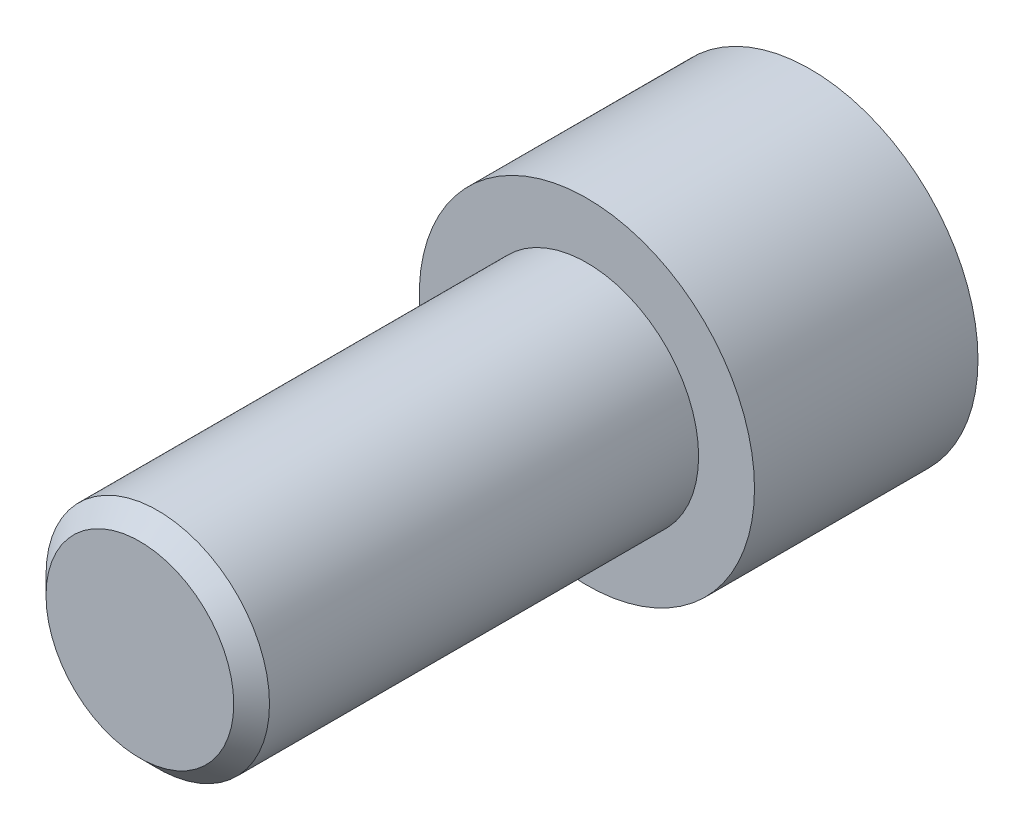
ISO-10303-21;
HEADER;
FILE_DESCRIPTION(('STEP AP214'),'2;1');
FILE_NAME('part.step','',(''),(''),'','','');
FILE_SCHEMA(('AUTOMOTIVE_DESIGN { 1 0 10303 214 1 1 1 1 }'));
ENDSEC;
DATA;
#1=APPLICATION_CONTEXT('core data for automotive mechanical design processes');
#2=APPLICATION_PROTOCOL_DEFINITION('international standard','automotive_design',2000,#1);
#3=PRODUCT_CONTEXT('',#1,'mechanical');
#4=PRODUCT('Part','Part','',(#3));
#5=PRODUCT_RELATED_PRODUCT_CATEGORY('part','',(#4));
#6=PRODUCT_DEFINITION_FORMATION('','',#4);
#7=PRODUCT_DEFINITION_CONTEXT('part definition',#1,'design');
#8=PRODUCT_DEFINITION('design','',#6,#7);
#9=PRODUCT_DEFINITION_SHAPE('','',#8);
#10=(LENGTH_UNIT() NAMED_UNIT(*) SI_UNIT(.MILLI.,.METRE.));
#11=(NAMED_UNIT(*) PLANE_ANGLE_UNIT() SI_UNIT($,.RADIAN.));
#12=(NAMED_UNIT(*) SI_UNIT($,.STERADIAN.) SOLID_ANGLE_UNIT());
#13=UNCERTAINTY_MEASURE_WITH_UNIT(LENGTH_MEASURE(1.E-05),#10,'distance_accuracy_value','');
#14=(GEOMETRIC_REPRESENTATION_CONTEXT(3) GLOBAL_UNCERTAINTY_ASSIGNED_CONTEXT((#13)) GLOBAL_UNIT_ASSIGNED_CONTEXT((#10,
#11,#12)) REPRESENTATION_CONTEXT('',''));
#15=CARTESIAN_POINT('',(0.,0.,0.));
#16=DIRECTION('',(0.,0.,1.));
#17=DIRECTION('',(1.,0.,0.));
#18=AXIS2_PLACEMENT_3D('',#15,#16,#17);
#19=CARTESIAN_POINT('',(0.,0.,-6.35));
#20=DIRECTION('',(0.,0.,1.));
#21=DIRECTION('',(1.,0.,0.));
#22=AXIS2_PLACEMENT_3D('',#19,#20,#21);
#23=CYLINDRICAL_SURFACE('',#22,4.7625);
#24=CARTESIAN_POINT('',(0.,0.,-6.35));
#25=DIRECTION('',(0.,0.,1.));
#26=DIRECTION('',(1.,0.,0.));
#27=AXIS2_PLACEMENT_3D('',#24,#25,#26);
#28=CIRCLE('',#27,4.7625);
#29=CARTESIAN_POINT('',(4.7625,0.,-6.35));
#30=VERTEX_POINT('',#29);
#31=EDGE_CURVE('E175',#30,#30,#28,.T.);
#32=ORIENTED_EDGE('',*,*,#31,.T.);
#33=EDGE_LOOP('',(#32));
#34=FACE_BOUND('',#33,.T.);
#35=CARTESIAN_POINT('',(0.,0.,0.));
#36=DIRECTION('',(0.,0.,1.));
#37=DIRECTION('',(1.,0.,0.));
#38=AXIS2_PLACEMENT_3D('',#35,#36,#37);
#39=CIRCLE('',#38,4.7625);
#40=CARTESIAN_POINT('',(4.7625,0.,0.));
#41=VERTEX_POINT('',#40);
#42=EDGE_CURVE('E161',#41,#41,#39,.T.);
#43=ORIENTED_EDGE('',*,*,#42,.F.);
#44=EDGE_LOOP('',(#43));
#45=FACE_BOUND('',#44,.T.);
#46=ADVANCED_FACE('F45',(#34,#45),#23,.T.);
#47=CARTESIAN_POINT('',(0.,0.,-6.35));
#48=DIRECTION('',(0.,0.,1.));
#49=DIRECTION('',(1.,0.,0.));
#50=AXIS2_PLACEMENT_3D('',#47,#48,#49);
#51=PLANE('',#50);
#52=DIRECTION('',(0.866025403784439,-0.5,0.));
#53=VECTOR('',#52,1.);
#54=CARTESIAN_POINT('',(0.,2.9329393674833,-6.35));
#55=LINE('',#54,#53);
#56=CARTESIAN_POINT('',(0.,2.9329393674833,-6.35));
#57=VERTEX_POINT('',#56);
#58=CARTESIAN_POINT('',(2.54,1.46646968374165,-6.35));
#59=VERTEX_POINT('',#58);
#60=EDGE_CURVE('E142',#57,#59,#55,.T.);
#61=ORIENTED_EDGE('',*,*,#60,.F.);
#62=DIRECTION('',(0.866025403784439,0.5,0.));
#63=VECTOR('',#62,1.);
#64=CARTESIAN_POINT('',(-2.54,1.46646968374165,-6.35));
#65=LINE('',#64,#63);
#66=CARTESIAN_POINT('',(-2.54,1.46646968374165,-6.35));
#67=VERTEX_POINT('',#66);
#68=EDGE_CURVE('E62',#67,#57,#65,.T.);
#69=ORIENTED_EDGE('',*,*,#68,.F.);
#70=DIRECTION('',(0.,1.,0.));
#71=VECTOR('',#70,1.);
#72=CARTESIAN_POINT('',(-2.54,-1.46646968374165,-6.35));
#73=LINE('',#72,#71);
#74=CARTESIAN_POINT('',(-2.54,-1.46646968374165,-6.35));
#75=VERTEX_POINT('',#74);
#76=EDGE_CURVE('E155',#75,#67,#73,.T.);
#77=ORIENTED_EDGE('',*,*,#76,.F.);
#78=DIRECTION('',(-0.866025403784439,0.5,0.));
#79=VECTOR('',#78,1.);
#80=CARTESIAN_POINT('',(0.,-2.9329393674833,-6.35));
#81=LINE('',#80,#79);
#82=CARTESIAN_POINT('',(0.,-2.9329393674833,-6.35));
#83=VERTEX_POINT('',#82);
#84=EDGE_CURVE('E152',#83,#75,#81,.T.);
#85=ORIENTED_EDGE('',*,*,#84,.F.);
#86=DIRECTION('',(-0.866025403784439,-0.5,0.));
#87=VECTOR('',#86,1.);
#88=CARTESIAN_POINT('',(2.54,-1.46646968374165,-6.35));
#89=LINE('',#88,#87);
#90=CARTESIAN_POINT('',(2.54,-1.46646968374165,-6.35));
#91=VERTEX_POINT('',#90);
#92=EDGE_CURVE('E110',#91,#83,#89,.T.);
#93=ORIENTED_EDGE('',*,*,#92,.F.);
#94=DIRECTION('',(0.,-1.,0.));
#95=VECTOR('',#94,1.);
#96=CARTESIAN_POINT('',(2.54,1.46646968374165,-6.35));
#97=LINE('',#96,#95);
#98=EDGE_CURVE('E146',#59,#91,#97,.T.);
#99=ORIENTED_EDGE('',*,*,#98,.F.);
#100=EDGE_LOOP('',(#61,#69,#77,#85,#93,#99));
#101=FACE_BOUND('',#100,.T.);
#102=ORIENTED_EDGE('',*,*,#31,.F.);
#103=EDGE_LOOP('',(#102));
#104=FACE_BOUND('',#103,.T.);
#105=ADVANCED_FACE('F200',(#101,#104),#51,.F.);
#106=CARTESIAN_POINT('',(0.,0.,0.));
#107=DIRECTION('',(0.,0.,1.));
#108=DIRECTION('',(1.,0.,0.));
#109=AXIS2_PLACEMENT_3D('',#106,#107,#108);
#110=PLANE('',#109);
#111=CARTESIAN_POINT('',(0.,0.,0.));
#112=DIRECTION('',(0.,0.,1.));
#113=DIRECTION('',(1.,0.,0.));
#114=AXIS2_PLACEMENT_3D('',#111,#112,#113);
#115=CIRCLE('',#114,3.175);
#116=CARTESIAN_POINT('',(3.175,0.,0.));
#117=VERTEX_POINT('',#116);
#118=EDGE_CURVE('E171',#117,#117,#115,.T.);
#119=ORIENTED_EDGE('',*,*,#118,.F.);
#120=EDGE_LOOP('',(#119));
#121=FACE_BOUND('',#120,.T.);
#122=ORIENTED_EDGE('',*,*,#42,.T.);
#123=EDGE_LOOP('',(#122));
#124=FACE_BOUND('',#123,.T.);
#125=ADVANCED_FACE('F205',(#121,#124),#110,.T.);
#126=CARTESIAN_POINT('',(0.,0.,12.7));
#127=DIRECTION('',(0.,0.,-1.));
#128=DIRECTION('',(-1.,0.,0.));
#129=AXIS2_PLACEMENT_3D('',#126,#127,#128);
#130=CYLINDRICAL_SURFACE('',#129,3.175);
#131=CARTESIAN_POINT('',(0.,0.,12.192));
#132=DIRECTION('',(0.,0.,1.));
#133=DIRECTION('',(1.,0.,0.));
#134=AXIS2_PLACEMENT_3D('',#131,#132,#133);
#135=CIRCLE('',#134,3.175);
#136=CARTESIAN_POINT('',(3.175,0.,12.192));
#137=VERTEX_POINT('',#136);
#138=EDGE_CURVE('E11',#137,#137,#135,.F.);
#139=ORIENTED_EDGE('',*,*,#138,.T.);
#140=EDGE_LOOP('',(#139));
#141=FACE_BOUND('',#140,.T.);
#142=ORIENTED_EDGE('',*,*,#118,.T.);
#143=EDGE_LOOP('',(#142));
#144=FACE_BOUND('',#143,.T.);
#145=ADVANCED_FACE('F196',(#141,#144),#130,.T.);
#146=CARTESIAN_POINT('',(0.,0.,12.7));
#147=DIRECTION('',(0.,0.,1.));
#148=DIRECTION('',(1.,0.,0.));
#149=AXIS2_PLACEMENT_3D('',#146,#147,#148);
#150=PLANE('',#149);
#151=CARTESIAN_POINT('',(0.,0.,12.7));
#152=DIRECTION('',(0.,0.,1.));
#153=DIRECTION('',(1.,0.,0.));
#154=AXIS2_PLACEMENT_3D('',#151,#152,#153);
#155=CIRCLE('',#154,2.667);
#156=CARTESIAN_POINT('',(2.667,0.,12.7));
#157=VERTEX_POINT('',#156);
#158=EDGE_CURVE('E55',#157,#157,#155,.T.);
#159=ORIENTED_EDGE('',*,*,#158,.T.);
#160=EDGE_LOOP('',(#159));
#161=FACE_BOUND('',#160,.T.);
#162=ADVANCED_FACE('F185',(#161),#150,.T.);
#163=CARTESIAN_POINT('',(0.,0.,12.7));
#164=DIRECTION('',(0.,0.,-1.));
#165=DIRECTION('',(-1.,0.,0.));
#166=AXIS2_PLACEMENT_3D('',#163,#164,#165);
#167=CONICAL_SURFACE('',#166,2.667,0.785398163397444);
#168=ORIENTED_EDGE('',*,*,#138,.F.);
#169=EDGE_LOOP('',(#168));
#170=FACE_BOUND('',#169,.T.);
#171=ORIENTED_EDGE('',*,*,#158,.F.);
#172=EDGE_LOOP('',(#171));
#173=FACE_BOUND('',#172,.T.);
#174=ADVANCED_FACE('F48',(#170,#173),#167,.T.);
#175=CARTESIAN_POINT('',(-2.54,1.46646968374165,-2.54));
#176=DIRECTION('',(-0.5,0.866025403784439,0.));
#177=DIRECTION('',(-0.866025403784439,-0.5,0.));
#178=AXIS2_PLACEMENT_3D('',#175,#176,#177);
#179=PLANE('',#178);
#180=ORIENTED_EDGE('',*,*,#68,.T.);
#181=DIRECTION('',(0.,0.,-1.));
#182=VECTOR('',#181,1.);
#183=CARTESIAN_POINT('',(0.,2.9329393674833,-2.54));
#184=LINE('',#183,#182);
#185=CARTESIAN_POINT('',(0.,2.9329393674833,-2.54));
#186=VERTEX_POINT('',#185);
#187=EDGE_CURVE('E92',#186,#57,#184,.T.);
#188=ORIENTED_EDGE('',*,*,#187,.F.);
#189=DIRECTION('',(0.866025403784439,0.5,0.));
#190=VECTOR('',#189,1.);
#191=CARTESIAN_POINT('',(-2.54,1.46646968374165,-2.54));
#192=LINE('',#191,#190);
#193=CARTESIAN_POINT('',(-2.54,1.46646968374165,-2.54));
#194=VERTEX_POINT('',#193);
#195=EDGE_CURVE('E158',#194,#186,#192,.T.);
#196=ORIENTED_EDGE('',*,*,#195,.F.);
#197=DIRECTION('',(0.,0.,-1.));
#198=VECTOR('',#197,1.);
#199=CARTESIAN_POINT('',(-2.54,1.46646968374165,-2.54));
#200=LINE('',#199,#198);
#201=EDGE_CURVE('E70',#194,#67,#200,.T.);
#202=ORIENTED_EDGE('',*,*,#201,.T.);
#203=EDGE_LOOP('',(#180,#188,#196,#202));
#204=FACE_BOUND('',#203,.T.);
#205=ADVANCED_FACE('F188',(#204),#179,.F.);
#206=CARTESIAN_POINT('',(-2.54,-1.46646968374165,-2.54));
#207=DIRECTION('',(-1.,0.,0.));
#208=DIRECTION('',(0.,0.,1.));
#209=AXIS2_PLACEMENT_3D('',#206,#207,#208);
#210=PLANE('',#209);
#211=ORIENTED_EDGE('',*,*,#76,.T.);
#212=ORIENTED_EDGE('',*,*,#201,.F.);
#213=DIRECTION('',(0.,1.,0.));
#214=VECTOR('',#213,1.);
#215=CARTESIAN_POINT('',(-2.54,-1.46646968374165,-2.54));
#216=LINE('',#215,#214);
#217=CARTESIAN_POINT('',(-2.54,-1.46646968374165,-2.54));
#218=VERTEX_POINT('',#217);
#219=EDGE_CURVE('E124',#218,#194,#216,.T.);
#220=ORIENTED_EDGE('',*,*,#219,.F.);
#221=DIRECTION('',(0.,0.,-1.));
#222=VECTOR('',#221,1.);
#223=CARTESIAN_POINT('',(-2.54,-1.46646968374165,-2.54));
#224=LINE('',#223,#222);
#225=EDGE_CURVE('E115',#218,#75,#224,.T.);
#226=ORIENTED_EDGE('',*,*,#225,.T.);
#227=EDGE_LOOP('',(#211,#212,#220,#226));
#228=FACE_BOUND('',#227,.T.);
#229=ADVANCED_FACE('F194',(#228),#210,.F.);
#230=CARTESIAN_POINT('',(0.,-2.9329393674833,-2.54));
#231=DIRECTION('',(-0.5,-0.866025403784439,0.));
#232=DIRECTION('',(0.866025403784439,-0.5,0.));
#233=AXIS2_PLACEMENT_3D('',#230,#231,#232);
#234=PLANE('',#233);
#235=ORIENTED_EDGE('',*,*,#84,.T.);
#236=ORIENTED_EDGE('',*,*,#225,.F.);
#237=DIRECTION('',(-0.866025403784439,0.5,0.));
#238=VECTOR('',#237,1.);
#239=CARTESIAN_POINT('',(0.,-2.9329393674833,-2.54));
#240=LINE('',#239,#238);
#241=CARTESIAN_POINT('',(0.,-2.9329393674833,-2.54));
#242=VERTEX_POINT('',#241);
#243=EDGE_CURVE('E119',#242,#218,#240,.T.);
#244=ORIENTED_EDGE('',*,*,#243,.F.);
#245=DIRECTION('',(0.,0.,-1.));
#246=VECTOR('',#245,1.);
#247=CARTESIAN_POINT('',(0.,-2.9329393674833,-2.54));
#248=LINE('',#247,#246);
#249=EDGE_CURVE('E103',#242,#83,#248,.T.);
#250=ORIENTED_EDGE('',*,*,#249,.T.);
#251=EDGE_LOOP('',(#235,#236,#244,#250));
#252=FACE_BOUND('',#251,.T.);
#253=ADVANCED_FACE('F120',(#252),#234,.F.);
#254=CARTESIAN_POINT('',(2.54,-1.46646968374165,-2.54));
#255=DIRECTION('',(0.5,-0.866025403784439,0.));
#256=DIRECTION('',(0.866025403784439,0.5,0.));
#257=AXIS2_PLACEMENT_3D('',#254,#255,#256);
#258=PLANE('',#257);
#259=ORIENTED_EDGE('',*,*,#92,.T.);
#260=ORIENTED_EDGE('',*,*,#249,.F.);
#261=DIRECTION('',(-0.866025403784439,-0.5,0.));
#262=VECTOR('',#261,1.);
#263=CARTESIAN_POINT('',(2.54,-1.46646968374165,-2.54));
#264=LINE('',#263,#262);
#265=CARTESIAN_POINT('',(2.54,-1.46646968374165,-2.54));
#266=VERTEX_POINT('',#265);
#267=EDGE_CURVE('E107',#266,#242,#264,.T.);
#268=ORIENTED_EDGE('',*,*,#267,.F.);
#269=DIRECTION('',(0.,0.,-1.));
#270=VECTOR('',#269,1.);
#271=CARTESIAN_POINT('',(2.54,-1.46646968374165,-2.54));
#272=LINE('',#271,#270);
#273=EDGE_CURVE('E116',#266,#91,#272,.T.);
#274=ORIENTED_EDGE('',*,*,#273,.T.);
#275=EDGE_LOOP('',(#259,#260,#268,#274));
#276=FACE_BOUND('',#275,.T.);
#277=ADVANCED_FACE('F105',(#276),#258,.F.);
#278=CARTESIAN_POINT('',(2.54,1.46646968374165,-2.54));
#279=DIRECTION('',(1.,0.,0.));
#280=DIRECTION('',(0.,0.,-1.));
#281=AXIS2_PLACEMENT_3D('',#278,#279,#280);
#282=PLANE('',#281);
#283=ORIENTED_EDGE('',*,*,#98,.T.);
#284=ORIENTED_EDGE('',*,*,#273,.F.);
#285=DIRECTION('',(0.,-1.,0.));
#286=VECTOR('',#285,1.);
#287=CARTESIAN_POINT('',(2.54,1.46646968374165,-2.54));
#288=LINE('',#287,#286);
#289=CARTESIAN_POINT('',(2.54,1.46646968374165,-2.54));
#290=VERTEX_POINT('',#289);
#291=EDGE_CURVE('E130',#290,#266,#288,.T.);
#292=ORIENTED_EDGE('',*,*,#291,.F.);
#293=DIRECTION('',(0.,0.,-1.));
#294=VECTOR('',#293,1.);
#295=CARTESIAN_POINT('',(2.54,1.46646968374165,-2.54));
#296=LINE('',#295,#294);
#297=EDGE_CURVE('E166',#290,#59,#296,.T.);
#298=ORIENTED_EDGE('',*,*,#297,.T.);
#299=EDGE_LOOP('',(#283,#284,#292,#298));
#300=FACE_BOUND('',#299,.T.);
#301=ADVANCED_FACE('F219',(#300),#282,.F.);
#302=CARTESIAN_POINT('',(0.,2.9329393674833,-2.54));
#303=DIRECTION('',(0.5,0.866025403784439,0.));
#304=DIRECTION('',(-0.866025403784439,0.5,0.));
#305=AXIS2_PLACEMENT_3D('',#302,#303,#304);
#306=PLANE('',#305);
#307=ORIENTED_EDGE('',*,*,#60,.T.);
#308=ORIENTED_EDGE('',*,*,#297,.F.);
#309=DIRECTION('',(0.866025403784439,-0.5,0.));
#310=VECTOR('',#309,1.);
#311=CARTESIAN_POINT('',(0.,2.9329393674833,-2.54));
#312=LINE('',#311,#310);
#313=EDGE_CURVE('E134',#186,#290,#312,.T.);
#314=ORIENTED_EDGE('',*,*,#313,.F.);
#315=ORIENTED_EDGE('',*,*,#187,.T.);
#316=EDGE_LOOP('',(#307,#308,#314,#315));
#317=FACE_BOUND('',#316,.T.);
#318=ADVANCED_FACE('F216',(#317),#306,.F.);
#319=CARTESIAN_POINT('',(0.,0.,-2.54));
#320=DIRECTION('',(0.,0.,-1.));
#321=DIRECTION('',(-1.,0.,0.));
#322=AXIS2_PLACEMENT_3D('',#319,#320,#321);
#323=PLANE('',#322);
#324=ORIENTED_EDGE('',*,*,#195,.T.);
#325=ORIENTED_EDGE('',*,*,#313,.T.);
#326=ORIENTED_EDGE('',*,*,#291,.T.);
#327=ORIENTED_EDGE('',*,*,#267,.T.);
#328=ORIENTED_EDGE('',*,*,#243,.T.);
#329=ORIENTED_EDGE('',*,*,#219,.T.);
#330=EDGE_LOOP('',(#324,#325,#326,#327,#328,#329));
#331=FACE_BOUND('',#330,.T.);
#332=ADVANCED_FACE('F127',(#331),#323,.T.);
#333=CLOSED_SHELL('',(#46,#105,#125,#145,#162,#174,#205,#229,#253,#277,#301,#318,#332));
#334=MANIFOLD_SOLID_BREP('B2',#333);
#335=ADVANCED_BREP_SHAPE_REPRESENTATION('',(#18,#334),#14);
#336=SHAPE_DEFINITION_REPRESENTATION(#9,#335);
ENDSEC;
END-ISO-10303-21;
